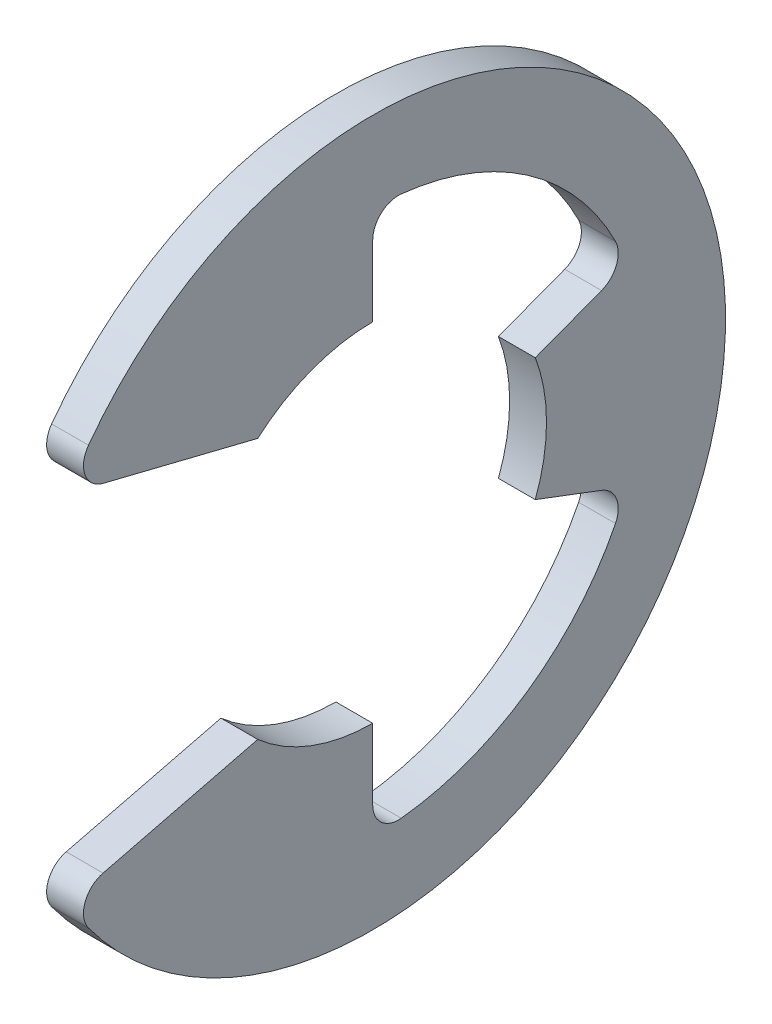
ISO-10303-21;
HEADER;
FILE_DESCRIPTION(('STEP AP214'),'2;1');
FILE_NAME('part.step','',(''),(''),'','','');
FILE_SCHEMA(('AUTOMOTIVE_DESIGN { 1 0 10303 214 1 1 1 1 }'));
ENDSEC;
DATA;
#1=APPLICATION_CONTEXT('core data for automotive mechanical design processes');
#2=APPLICATION_PROTOCOL_DEFINITION('international standard','automotive_design',2000,#1);
#3=PRODUCT_CONTEXT('',#1,'mechanical');
#4=PRODUCT('Part','Part','',(#3));
#5=PRODUCT_RELATED_PRODUCT_CATEGORY('part','',(#4));
#6=PRODUCT_DEFINITION_FORMATION('','',#4);
#7=PRODUCT_DEFINITION_CONTEXT('part definition',#1,'design');
#8=PRODUCT_DEFINITION('design','',#6,#7);
#9=PRODUCT_DEFINITION_SHAPE('','',#8);
#10=(LENGTH_UNIT() NAMED_UNIT(*) SI_UNIT(.MILLI.,.METRE.));
#11=(NAMED_UNIT(*) PLANE_ANGLE_UNIT() SI_UNIT($,.RADIAN.));
#12=(NAMED_UNIT(*) SI_UNIT($,.STERADIAN.) SOLID_ANGLE_UNIT());
#13=UNCERTAINTY_MEASURE_WITH_UNIT(LENGTH_MEASURE(1.E-05),#10,'distance_accuracy_value','');
#14=(GEOMETRIC_REPRESENTATION_CONTEXT(3) GLOBAL_UNCERTAINTY_ASSIGNED_CONTEXT((#13)) GLOBAL_UNIT_ASSIGNED_CONTEXT((#10,
#11,#12)) REPRESENTATION_CONTEXT('',''));
#15=CARTESIAN_POINT('',(0.,0.,0.));
#16=DIRECTION('',(0.,0.,1.));
#17=DIRECTION('',(1.,0.,0.));
#18=AXIS2_PLACEMENT_3D('',#15,#16,#17);
#19=CARTESIAN_POINT('',(-0.5334,0.,0.));
#20=DIRECTION('',(1.,0.,0.));
#21=DIRECTION('',(0.,0.,-1.));
#22=AXIS2_PLACEMENT_3D('',#19,#20,#21);
#23=PLANE('',#22);
#24=CARTESIAN_POINT('',(-0.5334,-5.60812276543936,7.62345146041875));
#25=DIRECTION('',(-1.,0.,0.));
#26=DIRECTION('',(0.,0.,1.));
#27=AXIS2_PLACEMENT_3D('',#24,#25,#26);
#28=CIRCLE('',#27,0.746760000000001);
#29=CARTESIAN_POINT('',(-0.5334,-4.88336468232429,7.80338538873514));
#30=VERTEX_POINT('',#29);
#31=CARTESIAN_POINT('',(-0.5334,-6.05063164709239,8.22497983652265));
#32=VERTEX_POINT('',#31);
#33=EDGE_CURVE('E20',#30,#32,#28,.F.);
#34=ORIENTED_EDGE('',*,*,#33,.F.);
#35=DIRECTION('',(0.,0.240952820606873,-0.970536829925373));
#36=VECTOR('',#35,1.);
#37=CARTESIAN_POINT('',(-0.5334,-5.13688856516319,8.82455735485331));
#38=LINE('',#37,#36);
#39=CARTESIAN_POINT('',(-0.5334,-3.7719,3.32650312340151));
#40=VERTEX_POINT('',#39);
#41=EDGE_CURVE('E144',#30,#40,#38,.T.);
#42=ORIENTED_EDGE('',*,*,#41,.T.);
#43=CARTESIAN_POINT('',(-0.5334,0.,0.));
#44=DIRECTION('',(-1.,0.,0.));
#45=DIRECTION('',(0.,0.,1.));
#46=AXIS2_PLACEMENT_3D('',#43,#44,#45);
#47=CIRCLE('',#46,5.0292);
#48=CARTESIAN_POINT('',(-0.5334,-5.0292,0.));
#49=VERTEX_POINT('',#48);
#50=EDGE_CURVE('E222',#40,#49,#47,.F.);
#51=ORIENTED_EDGE('',*,*,#50,.T.);
#52=DIRECTION('',(0.,-1.,0.));
#53=VECTOR('',#52,1.);
#54=CARTESIAN_POINT('',(-0.5334,-5.0292,0.));
#55=LINE('',#54,#53);
#56=CARTESIAN_POINT('',(-0.5334,-7.07977202193844,0.));
#57=VERTEX_POINT('',#56);
#58=EDGE_CURVE('E165',#49,#57,#55,.T.);
#59=ORIENTED_EDGE('',*,*,#58,.T.);
#60=CARTESIAN_POINT('',(-0.5334,-7.07977202193844,-0.74676));
#61=DIRECTION('',(-1.,0.,0.));
#62=DIRECTION('',(0.,0.,1.));
#63=AXIS2_PLACEMENT_3D('',#60,#61,#62);
#64=CIRCLE('',#63,0.74676);
#65=CARTESIAN_POINT('',(-0.5334,-7.82241228858608,-0.825092189765901));
#66=VERTEX_POINT('',#65);
#67=EDGE_CURVE('E224',#57,#66,#64,.F.);
#68=ORIENTED_EDGE('',*,*,#67,.T.);
#69=CARTESIAN_POINT('',(-0.5334,0.,0.));
#70=DIRECTION('',(-1.,0.,0.));
#71=DIRECTION('',(0.,0.,1.));
#72=AXIS2_PLACEMENT_3D('',#69,#70,#71);
#73=CIRCLE('',#72,7.8658064516129);
#74=CARTESIAN_POINT('',(-0.5334,-3.53744345889986,-7.02548253925108));
#75=VERTEX_POINT('',#74);
#76=EDGE_CURVE('E226',#66,#75,#73,.F.);
#77=ORIENTED_EDGE('',*,*,#76,.T.);
#78=CARTESIAN_POINT('',(-0.5334,-3.20160742052056,-6.35850079068093));
#79=DIRECTION('',(-1.,0.,0.));
#80=DIRECTION('',(0.,0.,1.));
#81=AXIS2_PLACEMENT_3D('',#78,#79,#80);
#82=CIRCLE('',#81,0.74676);
#83=CARTESIAN_POINT('',(-0.5334,-2.50307740298373,-6.62252032064036));
#84=VERTEX_POINT('',#83);
#85=EDGE_CURVE('E172',#75,#84,#82,.F.);
#86=ORIENTED_EDGE('',*,*,#85,.T.);
#87=DIRECTION('',(0.,0.353553390593273,0.935414346693486));
#88=VECTOR('',#87,1.);
#89=CARTESIAN_POINT('',(-0.5334,-1.77809071197169,-4.70438583239088));
#90=LINE('',#89,#88);
#91=CARTESIAN_POINT('',(-0.5334,-1.77809071197169,-4.70438583239088));
#92=VERTEX_POINT('',#91);
#93=EDGE_CURVE('E169',#84,#92,#90,.T.);
#94=ORIENTED_EDGE('',*,*,#93,.T.);
#95=CARTESIAN_POINT('',(-0.5334,0.,0.));
#96=DIRECTION('',(-1.,0.,0.));
#97=DIRECTION('',(0.,0.,1.));
#98=AXIS2_PLACEMENT_3D('',#95,#96,#97);
#99=CIRCLE('',#98,5.0292);
#100=CARTESIAN_POINT('',(-0.5334,1.77809071197169,-4.70438583239087));
#101=VERTEX_POINT('',#100);
#102=EDGE_CURVE('E232',#92,#101,#99,.F.);
#103=ORIENTED_EDGE('',*,*,#102,.T.);
#104=DIRECTION('',(0.,0.353553390593273,-0.935414346693486));
#105=VECTOR('',#104,1.);
#106=CARTESIAN_POINT('',(-0.5334,1.77809071197169,-4.70438583239088));
#107=LINE('',#106,#105);
#108=CARTESIAN_POINT('',(-0.5334,2.50307740298373,-6.62252032064036));
#109=VERTEX_POINT('',#108);
#110=EDGE_CURVE('E174',#101,#109,#107,.T.);
#111=ORIENTED_EDGE('',*,*,#110,.T.);
#112=CARTESIAN_POINT('',(-0.5334,3.20160742052056,-6.35850079068093));
#113=DIRECTION('',(-1.,0.,0.));
#114=DIRECTION('',(0.,0.,1.));
#115=AXIS2_PLACEMENT_3D('',#112,#113,#114);
#116=CIRCLE('',#115,0.74676);
#117=CARTESIAN_POINT('',(-0.5334,3.53744345889986,-7.02548253925108));
#118=VERTEX_POINT('',#117);
#119=EDGE_CURVE('E236',#109,#118,#116,.F.);
#120=ORIENTED_EDGE('',*,*,#119,.T.);
#121=CARTESIAN_POINT('',(-0.5334,0.,0.));
#122=DIRECTION('',(-1.,0.,0.));
#123=DIRECTION('',(0.,0.,1.));
#124=AXIS2_PLACEMENT_3D('',#121,#122,#123);
#125=CIRCLE('',#124,7.8658064516129);
#126=CARTESIAN_POINT('',(-0.5334,7.82241228858608,-0.825092189765899));
#127=VERTEX_POINT('',#126);
#128=EDGE_CURVE('E239',#118,#127,#125,.F.);
#129=ORIENTED_EDGE('',*,*,#128,.T.);
#130=CARTESIAN_POINT('',(-0.5334,7.07977202193844,-0.746759999999999));
#131=DIRECTION('',(-1.,0.,0.));
#132=DIRECTION('',(0.,0.,1.));
#133=AXIS2_PLACEMENT_3D('',#130,#131,#132);
#134=CIRCLE('',#133,0.74676);
#135=CARTESIAN_POINT('',(-0.5334,7.07977202193844,0.));
#136=VERTEX_POINT('',#135);
#137=EDGE_CURVE('E181',#127,#136,#134,.F.);
#138=ORIENTED_EDGE('',*,*,#137,.T.);
#139=DIRECTION('',(0.,-1.,0.));
#140=VECTOR('',#139,1.);
#141=CARTESIAN_POINT('',(-0.5334,5.0292,0.));
#142=LINE('',#141,#140);
#143=CARTESIAN_POINT('',(-0.5334,5.0292,0.));
#144=VERTEX_POINT('',#143);
#145=EDGE_CURVE('E178',#136,#144,#142,.T.);
#146=ORIENTED_EDGE('',*,*,#145,.T.);
#147=CARTESIAN_POINT('',(-0.5334,0.,0.));
#148=DIRECTION('',(-1.,0.,0.));
#149=DIRECTION('',(0.,0.,1.));
#150=AXIS2_PLACEMENT_3D('',#147,#148,#149);
#151=CIRCLE('',#150,5.0292);
#152=CARTESIAN_POINT('',(-0.5334,3.7719,3.32650312340151));
#153=VERTEX_POINT('',#152);
#154=EDGE_CURVE('E243',#144,#153,#151,.F.);
#155=ORIENTED_EDGE('',*,*,#154,.T.);
#156=DIRECTION('',(0.,0.240952820606873,0.970536829925373));
#157=VECTOR('',#156,1.);
#158=CARTESIAN_POINT('',(-0.5334,5.13688856516319,8.82455735485332));
#159=LINE('',#158,#157);
#160=CARTESIAN_POINT('',(-0.5334,4.88336468232429,7.80338538873514));
#161=VERTEX_POINT('',#160);
#162=EDGE_CURVE('E183',#153,#161,#159,.T.);
#163=ORIENTED_EDGE('',*,*,#162,.T.);
#164=CARTESIAN_POINT('',(-0.5334,5.60812276543936,7.62345146041875));
#165=DIRECTION('',(-1.,0.,0.));
#166=DIRECTION('',(0.,0.,1.));
#167=AXIS2_PLACEMENT_3D('',#164,#165,#166);
#168=CIRCLE('',#167,0.74676);
#169=CARTESIAN_POINT('',(-0.5334,6.05063164709238,8.22497983652265));
#170=VERTEX_POINT('',#169);
#171=EDGE_CURVE('E185',#170,#161,#168,.F.);
#172=ORIENTED_EDGE('',*,*,#171,.F.);
#173=CARTESIAN_POINT('',(-0.5334,0.,0.));
#174=DIRECTION('',(-1.,0.,0.));
#175=DIRECTION('',(0.,0.,1.));
#176=AXIS2_PLACEMENT_3D('',#173,#174,#175);
#177=CIRCLE('',#176,10.2108);
#178=EDGE_CURVE('E147',#32,#170,#177,.F.);
#179=ORIENTED_EDGE('',*,*,#178,.F.);
#180=EDGE_LOOP('',(#34,#42,#51,#59,#68,#77,#86,#94,#103,#111,#120,#129,#138,#146,#155,#163,#172,#179));
#181=FACE_BOUND('',#180,.T.);
#182=ADVANCED_FACE('F17',(#181),#23,.F.);
#183=CARTESIAN_POINT('',(0.5334,-5.13688856516319,8.82455735485331));
#184=DIRECTION('',(0.,-0.970536829925373,-0.240952820606873));
#185=DIRECTION('',(0.,0.240952820606873,-0.970536829925373));
#186=AXIS2_PLACEMENT_3D('',#183,#184,#185);
#187=PLANE('',#186);
#188=DIRECTION('',(-1.,0.,0.));
#189=VECTOR('',#188,1.);
#190=CARTESIAN_POINT('',(0.5334,-4.88336468232429,7.80338538873514));
#191=LINE('',#190,#189);
#192=CARTESIAN_POINT('',(0.5334,-4.88336468232429,7.80338538873514));
#193=VERTEX_POINT('',#192);
#194=EDGE_CURVE('E150',#193,#30,#191,.T.);
#195=ORIENTED_EDGE('',*,*,#194,.F.);
#196=DIRECTION('',(0.,-0.240952820606873,0.970536829925373));
#197=VECTOR('',#196,1.);
#198=CARTESIAN_POINT('',(0.5334,-3.7719,3.32650312340151));
#199=LINE('',#198,#197);
#200=CARTESIAN_POINT('',(0.5334,-3.7719,3.32650312340151));
#201=VERTEX_POINT('',#200);
#202=EDGE_CURVE('E221',#201,#193,#199,.T.);
#203=ORIENTED_EDGE('',*,*,#202,.F.);
#204=DIRECTION('',(-1.,0.,0.));
#205=VECTOR('',#204,1.);
#206=CARTESIAN_POINT('',(0.5334,-3.7719,3.32650312340151));
#207=LINE('',#206,#205);
#208=EDGE_CURVE('E155',#201,#40,#207,.T.);
#209=ORIENTED_EDGE('',*,*,#208,.T.);
#210=ORIENTED_EDGE('',*,*,#41,.F.);
#211=EDGE_LOOP('',(#195,#203,#209,#210));
#212=FACE_BOUND('',#211,.T.);
#213=ADVANCED_FACE('F152',(#212),#187,.F.);
#214=CARTESIAN_POINT('',(0.5334,-5.60812276543936,7.62345146041875));
#215=DIRECTION('',(-1.,0.,0.));
#216=DIRECTION('',(0.,0.,1.));
#217=AXIS2_PLACEMENT_3D('',#214,#215,#216);
#218=CYLINDRICAL_SURFACE('',#217,0.746760000000001);
#219=ORIENTED_EDGE('',*,*,#33,.T.);
#220=DIRECTION('',(-1.,0.,0.));
#221=VECTOR('',#220,1.);
#222=CARTESIAN_POINT('',(0.5334,-6.05063164709239,8.22497983652265));
#223=LINE('',#222,#221);
#224=CARTESIAN_POINT('',(0.5334,-6.05063164709239,8.22497983652265));
#225=VERTEX_POINT('',#224);
#226=EDGE_CURVE('E149',#225,#32,#223,.T.);
#227=ORIENTED_EDGE('',*,*,#226,.F.);
#228=CARTESIAN_POINT('',(0.5334,-5.60812276543936,7.62345146041875));
#229=DIRECTION('',(-1.,0.,0.));
#230=DIRECTION('',(0.,0.,1.));
#231=AXIS2_PLACEMENT_3D('',#228,#229,#230);
#232=CIRCLE('',#231,0.746760000000001);
#233=EDGE_CURVE('E159',#193,#225,#232,.F.);
#234=ORIENTED_EDGE('',*,*,#233,.F.);
#235=ORIENTED_EDGE('',*,*,#194,.T.);
#236=EDGE_LOOP('',(#219,#227,#234,#235));
#237=FACE_BOUND('',#236,.T.);
#238=ADVANCED_FACE('F158',(#237),#218,.T.);
#239=CARTESIAN_POINT('',(0.5334,0.,0.));
#240=DIRECTION('',(-1.,0.,0.));
#241=DIRECTION('',(0.,0.,1.));
#242=AXIS2_PLACEMENT_3D('',#239,#240,#241);
#243=CYLINDRICAL_SURFACE('',#242,10.2108);
#244=ORIENTED_EDGE('',*,*,#178,.T.);
#245=DIRECTION('',(-1.,0.,0.));
#246=VECTOR('',#245,1.);
#247=CARTESIAN_POINT('',(0.5334,6.05063164709238,8.22497983652265));
#248=LINE('',#247,#246);
#249=CARTESIAN_POINT('',(0.5334,6.05063164709238,8.22497983652265));
#250=VERTEX_POINT('',#249);
#251=EDGE_CURVE('E248',#250,#170,#248,.T.);
#252=ORIENTED_EDGE('',*,*,#251,.F.);
#253=CARTESIAN_POINT('',(0.5334,0.,0.));
#254=DIRECTION('',(-1.,0.,0.));
#255=DIRECTION('',(0.,0.,1.));
#256=AXIS2_PLACEMENT_3D('',#253,#254,#255);
#257=CIRCLE('',#256,10.2108);
#258=EDGE_CURVE('E217',#225,#250,#257,.F.);
#259=ORIENTED_EDGE('',*,*,#258,.F.);
#260=ORIENTED_EDGE('',*,*,#226,.T.);
#261=EDGE_LOOP('',(#244,#252,#259,#260));
#262=FACE_BOUND('',#261,.T.);
#263=ADVANCED_FACE('F252',(#262),#243,.T.);
#264=CARTESIAN_POINT('',(0.5334,5.60812276543936,7.62345146041875));
#265=DIRECTION('',(-1.,0.,0.));
#266=DIRECTION('',(0.,0.,1.));
#267=AXIS2_PLACEMENT_3D('',#264,#265,#266);
#268=CYLINDRICAL_SURFACE('',#267,0.74676);
#269=ORIENTED_EDGE('',*,*,#171,.T.);
#270=DIRECTION('',(1.,0.,0.));
#271=VECTOR('',#270,1.);
#272=CARTESIAN_POINT('',(0.5334,4.88336468232429,7.80338538873514));
#273=LINE('',#272,#271);
#274=CARTESIAN_POINT('',(0.5334,4.88336468232429,7.80338538873514));
#275=VERTEX_POINT('',#274);
#276=EDGE_CURVE('E184',#161,#275,#273,.T.);
#277=ORIENTED_EDGE('',*,*,#276,.T.);
#278=CARTESIAN_POINT('',(0.5334,5.60812276543936,7.62345146041875));
#279=DIRECTION('',(-1.,0.,0.));
#280=DIRECTION('',(0.,0.,1.));
#281=AXIS2_PLACEMENT_3D('',#278,#279,#280);
#282=CIRCLE('',#281,0.74676);
#283=EDGE_CURVE('E215',#250,#275,#282,.F.);
#284=ORIENTED_EDGE('',*,*,#283,.F.);
#285=ORIENTED_EDGE('',*,*,#251,.T.);
#286=EDGE_LOOP('',(#269,#277,#284,#285));
#287=FACE_BOUND('',#286,.T.);
#288=ADVANCED_FACE('F280',(#287),#268,.T.);
#289=CARTESIAN_POINT('',(0.5334,5.13688856516319,8.82455735485332));
#290=DIRECTION('',(0.,0.970536829925373,-0.240952820606873));
#291=DIRECTION('',(0.,0.240952820606873,0.970536829925373));
#292=AXIS2_PLACEMENT_3D('',#289,#290,#291);
#293=PLANE('',#292);
#294=ORIENTED_EDGE('',*,*,#276,.F.);
#295=ORIENTED_EDGE('',*,*,#162,.F.);
#296=DIRECTION('',(-1.,0.,0.));
#297=VECTOR('',#296,1.);
#298=CARTESIAN_POINT('',(0.5334,3.7719,3.32650312340151));
#299=LINE('',#298,#297);
#300=CARTESIAN_POINT('',(0.5334,3.7719,3.32650312340151));
#301=VERTEX_POINT('',#300);
#302=EDGE_CURVE('E246',#153,#301,#299,.F.);
#303=ORIENTED_EDGE('',*,*,#302,.T.);
#304=DIRECTION('',(0.,-0.240952820606873,-0.970536829925373));
#305=VECTOR('',#304,1.);
#306=CARTESIAN_POINT('',(0.5334,4.88336468232429,7.80338538873514));
#307=LINE('',#306,#305);
#308=EDGE_CURVE('E214',#275,#301,#307,.T.);
#309=ORIENTED_EDGE('',*,*,#308,.F.);
#310=EDGE_LOOP('',(#294,#295,#303,#309));
#311=FACE_BOUND('',#310,.T.);
#312=ADVANCED_FACE('F282',(#311),#293,.F.);
#313=CARTESIAN_POINT('',(0.5334,0.,0.));
#314=DIRECTION('',(-1.,0.,0.));
#315=DIRECTION('',(0.,0.,1.));
#316=AXIS2_PLACEMENT_3D('',#313,#314,#315);
#317=CYLINDRICAL_SURFACE('',#316,5.0292);
#318=DIRECTION('',(1.,0.,0.));
#319=VECTOR('',#318,1.);
#320=CARTESIAN_POINT('',(0.5334,5.0292,0.));
#321=LINE('',#320,#319);
#322=CARTESIAN_POINT('',(0.5334,5.0292,0.));
#323=VERTEX_POINT('',#322);
#324=EDGE_CURVE('E182',#144,#323,#321,.T.);
#325=ORIENTED_EDGE('',*,*,#324,.T.);
#326=CARTESIAN_POINT('',(0.5334,0.,0.));
#327=DIRECTION('',(-1.,0.,0.));
#328=DIRECTION('',(0.,0.,1.));
#329=AXIS2_PLACEMENT_3D('',#326,#327,#328);
#330=CIRCLE('',#329,5.0292);
#331=EDGE_CURVE('E211',#301,#323,#330,.T.);
#332=ORIENTED_EDGE('',*,*,#331,.F.);
#333=ORIENTED_EDGE('',*,*,#302,.F.);
#334=ORIENTED_EDGE('',*,*,#154,.F.);
#335=EDGE_LOOP('',(#325,#332,#333,#334));
#336=FACE_BOUND('',#335,.T.);
#337=ADVANCED_FACE('F288',(#336),#317,.F.);
#338=CARTESIAN_POINT('',(0.5334,5.0292,0.));
#339=DIRECTION('',(0.,0.,1.));
#340=DIRECTION('',(0.,-1.,0.));
#341=AXIS2_PLACEMENT_3D('',#338,#339,#340);
#342=PLANE('',#341);
#343=DIRECTION('',(-1.,0.,0.));
#344=VECTOR('',#343,1.);
#345=CARTESIAN_POINT('',(0.5334,7.07977202193844,0.));
#346=LINE('',#345,#344);
#347=CARTESIAN_POINT('',(0.5334,7.07977202193844,0.));
#348=VERTEX_POINT('',#347);
#349=EDGE_CURVE('E241',#136,#348,#346,.F.);
#350=ORIENTED_EDGE('',*,*,#349,.T.);
#351=DIRECTION('',(0.,1.,0.));
#352=VECTOR('',#351,1.);
#353=CARTESIAN_POINT('',(0.5334,0.,0.));
#354=LINE('',#353,#352);
#355=EDGE_CURVE('E210',#323,#348,#354,.T.);
#356=ORIENTED_EDGE('',*,*,#355,.F.);
#357=ORIENTED_EDGE('',*,*,#324,.F.);
#358=ORIENTED_EDGE('',*,*,#145,.F.);
#359=EDGE_LOOP('',(#350,#356,#357,#358));
#360=FACE_BOUND('',#359,.T.);
#361=ADVANCED_FACE('F292',(#360),#342,.F.);
#362=CARTESIAN_POINT('',(0.5334,7.07977202193844,-0.746759999999999));
#363=DIRECTION('',(-1.,0.,0.));
#364=DIRECTION('',(0.,0.,1.));
#365=AXIS2_PLACEMENT_3D('',#362,#363,#364);
#366=CYLINDRICAL_SURFACE('',#365,0.74676);
#367=ORIENTED_EDGE('',*,*,#349,.F.);
#368=ORIENTED_EDGE('',*,*,#137,.F.);
#369=DIRECTION('',(-1.,0.,0.));
#370=VECTOR('',#369,1.);
#371=CARTESIAN_POINT('',(0.5334,7.82241228858608,-0.8250921897659));
#372=LINE('',#371,#370);
#373=CARTESIAN_POINT('',(0.5334,7.82241228858608,-0.825092189765899));
#374=VERTEX_POINT('',#373);
#375=EDGE_CURVE('E238',#127,#374,#372,.F.);
#376=ORIENTED_EDGE('',*,*,#375,.T.);
#377=CARTESIAN_POINT('',(0.5334,7.07977202193844,-0.746759999999999));
#378=DIRECTION('',(-1.,0.,0.));
#379=DIRECTION('',(0.,0.,1.));
#380=AXIS2_PLACEMENT_3D('',#377,#378,#379);
#381=CIRCLE('',#380,0.74676);
#382=EDGE_CURVE('E207',#348,#374,#381,.T.);
#383=ORIENTED_EDGE('',*,*,#382,.F.);
#384=EDGE_LOOP('',(#367,#368,#376,#383));
#385=FACE_BOUND('',#384,.T.);
#386=ADVANCED_FACE('F341',(#385),#366,.F.);
#387=CARTESIAN_POINT('',(0.5334,0.,0.));
#388=DIRECTION('',(-1.,0.,0.));
#389=DIRECTION('',(0.,0.,1.));
#390=AXIS2_PLACEMENT_3D('',#387,#388,#389);
#391=CYLINDRICAL_SURFACE('',#390,7.8658064516129);
#392=ORIENTED_EDGE('',*,*,#375,.F.);
#393=ORIENTED_EDGE('',*,*,#128,.F.);
#394=DIRECTION('',(-1.,0.,0.));
#395=VECTOR('',#394,1.);
#396=CARTESIAN_POINT('',(0.5334,3.53744345889986,-7.02548253925108));
#397=LINE('',#396,#395);
#398=CARTESIAN_POINT('',(0.5334,3.53744345889986,-7.02548253925108));
#399=VERTEX_POINT('',#398);
#400=EDGE_CURVE('E177',#118,#399,#397,.F.);
#401=ORIENTED_EDGE('',*,*,#400,.T.);
#402=CARTESIAN_POINT('',(0.5334,0.,0.));
#403=DIRECTION('',(-1.,0.,0.));
#404=DIRECTION('',(0.,0.,1.));
#405=AXIS2_PLACEMENT_3D('',#402,#403,#404);
#406=CIRCLE('',#405,7.8658064516129);
#407=EDGE_CURVE('E204',#374,#399,#406,.T.);
#408=ORIENTED_EDGE('',*,*,#407,.F.);
#409=EDGE_LOOP('',(#392,#393,#401,#408));
#410=FACE_BOUND('',#409,.T.);
#411=ADVANCED_FACE('F338',(#410),#391,.F.);
#412=CARTESIAN_POINT('',(0.5334,3.20160742052056,-6.35850079068093));
#413=DIRECTION('',(-1.,0.,0.));
#414=DIRECTION('',(0.,0.,1.));
#415=AXIS2_PLACEMENT_3D('',#412,#413,#414);
#416=CYLINDRICAL_SURFACE('',#415,0.74676);
#417=ORIENTED_EDGE('',*,*,#400,.F.);
#418=ORIENTED_EDGE('',*,*,#119,.F.);
#419=DIRECTION('',(1.,0.,0.));
#420=VECTOR('',#419,1.);
#421=CARTESIAN_POINT('',(0.5334,2.50307740298373,-6.62252032064036));
#422=LINE('',#421,#420);
#423=CARTESIAN_POINT('',(0.5334,2.50307740298373,-6.62252032064036));
#424=VERTEX_POINT('',#423);
#425=EDGE_CURVE('E176',#109,#424,#422,.T.);
#426=ORIENTED_EDGE('',*,*,#425,.T.);
#427=CARTESIAN_POINT('',(0.5334,3.20160742052056,-6.35850079068093));
#428=DIRECTION('',(-1.,0.,0.));
#429=DIRECTION('',(0.,0.,1.));
#430=AXIS2_PLACEMENT_3D('',#427,#428,#429);
#431=CIRCLE('',#430,0.74676);
#432=EDGE_CURVE('E201',#399,#424,#431,.T.);
#433=ORIENTED_EDGE('',*,*,#432,.F.);
#434=EDGE_LOOP('',(#417,#418,#426,#433));
#435=FACE_BOUND('',#434,.T.);
#436=ADVANCED_FACE('F331',(#435),#416,.F.);
#437=CARTESIAN_POINT('',(0.5334,1.77809071197169,-4.70438583239088));
#438=DIRECTION('',(0.,-0.935414346693486,-0.353553390593273));
#439=DIRECTION('',(0.,0.353553390593273,-0.935414346693486));
#440=AXIS2_PLACEMENT_3D('',#437,#438,#439);
#441=PLANE('',#440);
#442=ORIENTED_EDGE('',*,*,#425,.F.);
#443=ORIENTED_EDGE('',*,*,#110,.F.);
#444=DIRECTION('',(-1.,0.,0.));
#445=VECTOR('',#444,1.);
#446=CARTESIAN_POINT('',(0.5334,1.77809071197169,-4.70438583239087));
#447=LINE('',#446,#445);
#448=CARTESIAN_POINT('',(0.5334,1.77809071197169,-4.70438583239087));
#449=VERTEX_POINT('',#448);
#450=EDGE_CURVE('E235',#101,#449,#447,.F.);
#451=ORIENTED_EDGE('',*,*,#450,.T.);
#452=DIRECTION('',(0.,-0.353553390593273,0.935414346693486));
#453=VECTOR('',#452,1.);
#454=CARTESIAN_POINT('',(0.5334,2.50307740298373,-6.62252032064036));
#455=LINE('',#454,#453);
#456=EDGE_CURVE('E200',#424,#449,#455,.T.);
#457=ORIENTED_EDGE('',*,*,#456,.F.);
#458=EDGE_LOOP('',(#442,#443,#451,#457));
#459=FACE_BOUND('',#458,.T.);
#460=ADVANCED_FACE('F334',(#459),#441,.F.);
#461=CARTESIAN_POINT('',(0.5334,0.,0.));
#462=DIRECTION('',(-1.,0.,0.));
#463=DIRECTION('',(0.,0.,1.));
#464=AXIS2_PLACEMENT_3D('',#461,#462,#463);
#465=CYLINDRICAL_SURFACE('',#464,5.0292);
#466=DIRECTION('',(1.,0.,0.));
#467=VECTOR('',#466,1.);
#468=CARTESIAN_POINT('',(0.5334,-1.77809071197169,-4.70438583239088));
#469=LINE('',#468,#467);
#470=CARTESIAN_POINT('',(0.5334,-1.77809071197169,-4.70438583239088));
#471=VERTEX_POINT('',#470);
#472=EDGE_CURVE('E173',#92,#471,#469,.T.);
#473=ORIENTED_EDGE('',*,*,#472,.T.);
#474=CARTESIAN_POINT('',(0.5334,0.,0.));
#475=DIRECTION('',(-1.,0.,0.));
#476=DIRECTION('',(0.,0.,1.));
#477=AXIS2_PLACEMENT_3D('',#474,#475,#476);
#478=CIRCLE('',#477,5.0292);
#479=EDGE_CURVE('E197',#449,#471,#478,.T.);
#480=ORIENTED_EDGE('',*,*,#479,.F.);
#481=ORIENTED_EDGE('',*,*,#450,.F.);
#482=ORIENTED_EDGE('',*,*,#102,.F.);
#483=EDGE_LOOP('',(#473,#480,#481,#482));
#484=FACE_BOUND('',#483,.T.);
#485=ADVANCED_FACE('F323',(#484),#465,.F.);
#486=CARTESIAN_POINT('',(0.5334,-1.77809071197169,-4.70438583239088));
#487=DIRECTION('',(0.,0.935414346693486,-0.353553390593273));
#488=DIRECTION('',(0.,0.353553390593273,0.935414346693486));
#489=AXIS2_PLACEMENT_3D('',#486,#487,#488);
#490=PLANE('',#489);
#491=DIRECTION('',(-1.,0.,0.));
#492=VECTOR('',#491,1.);
#493=CARTESIAN_POINT('',(0.5334,-2.50307740298373,-6.62252032064036));
#494=LINE('',#493,#492);
#495=CARTESIAN_POINT('',(0.5334,-2.50307740298373,-6.62252032064036));
#496=VERTEX_POINT('',#495);
#497=EDGE_CURVE('E231',#84,#496,#494,.F.);
#498=ORIENTED_EDGE('',*,*,#497,.T.);
#499=DIRECTION('',(0.,-0.353553390593273,-0.935414346693486));
#500=VECTOR('',#499,1.);
#501=CARTESIAN_POINT('',(0.5334,-1.77809071197169,-4.70438583239088));
#502=LINE('',#501,#500);
#503=EDGE_CURVE('E196',#471,#496,#502,.T.);
#504=ORIENTED_EDGE('',*,*,#503,.F.);
#505=ORIENTED_EDGE('',*,*,#472,.F.);
#506=ORIENTED_EDGE('',*,*,#93,.F.);
#507=EDGE_LOOP('',(#498,#504,#505,#506));
#508=FACE_BOUND('',#507,.T.);
#509=ADVANCED_FACE('F319',(#508),#490,.F.);
#510=CARTESIAN_POINT('',(0.5334,-3.20160742052056,-6.35850079068093));
#511=DIRECTION('',(-1.,0.,0.));
#512=DIRECTION('',(0.,0.,1.));
#513=AXIS2_PLACEMENT_3D('',#510,#511,#512);
#514=CYLINDRICAL_SURFACE('',#513,0.74676);
#515=ORIENTED_EDGE('',*,*,#497,.F.);
#516=ORIENTED_EDGE('',*,*,#85,.F.);
#517=DIRECTION('',(-1.,0.,0.));
#518=VECTOR('',#517,1.);
#519=CARTESIAN_POINT('',(0.5334,-3.53744345889986,-7.02548253925108));
#520=LINE('',#519,#518);
#521=CARTESIAN_POINT('',(0.5334,-3.53744345889986,-7.02548253925108));
#522=VERTEX_POINT('',#521);
#523=EDGE_CURVE('E229',#75,#522,#520,.F.);
#524=ORIENTED_EDGE('',*,*,#523,.T.);
#525=CARTESIAN_POINT('',(0.5334,-3.20160742052056,-6.35850079068093));
#526=DIRECTION('',(-1.,0.,0.));
#527=DIRECTION('',(0.,0.,1.));
#528=AXIS2_PLACEMENT_3D('',#525,#526,#527);
#529=CIRCLE('',#528,0.74676);
#530=EDGE_CURVE('E193',#496,#522,#529,.T.);
#531=ORIENTED_EDGE('',*,*,#530,.F.);
#532=EDGE_LOOP('',(#515,#516,#524,#531));
#533=FACE_BOUND('',#532,.T.);
#534=ADVANCED_FACE('F315',(#533),#514,.F.);
#535=CARTESIAN_POINT('',(0.5334,0.,0.));
#536=DIRECTION('',(-1.,0.,0.));
#537=DIRECTION('',(0.,0.,1.));
#538=AXIS2_PLACEMENT_3D('',#535,#536,#537);
#539=CYLINDRICAL_SURFACE('',#538,7.8658064516129);
#540=DIRECTION('',(-1.,0.,0.));
#541=VECTOR('',#540,1.);
#542=CARTESIAN_POINT('',(0.5334,-7.82241228858608,-0.825092189765901));
#543=LINE('',#542,#541);
#544=CARTESIAN_POINT('',(0.5334,-7.82241228858608,-0.825092189765901));
#545=VERTEX_POINT('',#544);
#546=EDGE_CURVE('E168',#66,#545,#543,.F.);
#547=ORIENTED_EDGE('',*,*,#546,.T.);
#548=CARTESIAN_POINT('',(0.5334,0.,0.));
#549=DIRECTION('',(-1.,0.,0.));
#550=DIRECTION('',(0.,0.,1.));
#551=AXIS2_PLACEMENT_3D('',#548,#549,#550);
#552=CIRCLE('',#551,7.8658064516129);
#553=EDGE_CURVE('E190',#522,#545,#552,.T.);
#554=ORIENTED_EDGE('',*,*,#553,.F.);
#555=ORIENTED_EDGE('',*,*,#523,.F.);
#556=ORIENTED_EDGE('',*,*,#76,.F.);
#557=EDGE_LOOP('',(#547,#554,#555,#556));
#558=FACE_BOUND('',#557,.T.);
#559=ADVANCED_FACE('F310',(#558),#539,.F.);
#560=CARTESIAN_POINT('',(0.5334,-7.07977202193844,-0.74676));
#561=DIRECTION('',(-1.,0.,0.));
#562=DIRECTION('',(0.,0.,1.));
#563=AXIS2_PLACEMENT_3D('',#560,#561,#562);
#564=CYLINDRICAL_SURFACE('',#563,0.74676);
#565=ORIENTED_EDGE('',*,*,#546,.F.);
#566=ORIENTED_EDGE('',*,*,#67,.F.);
#567=DIRECTION('',(1.,0.,0.));
#568=VECTOR('',#567,1.);
#569=CARTESIAN_POINT('',(0.5334,-7.07977202193844,0.));
#570=LINE('',#569,#568);
#571=CARTESIAN_POINT('',(0.5334,-7.07977202193844,0.));
#572=VERTEX_POINT('',#571);
#573=EDGE_CURVE('E167',#57,#572,#570,.T.);
#574=ORIENTED_EDGE('',*,*,#573,.T.);
#575=CARTESIAN_POINT('',(0.5334,-7.07977202193844,-0.74676));
#576=DIRECTION('',(-1.,0.,0.));
#577=DIRECTION('',(0.,0.,1.));
#578=AXIS2_PLACEMENT_3D('',#575,#576,#577);
#579=CIRCLE('',#578,0.74676);
#580=EDGE_CURVE('E187',#545,#572,#579,.T.);
#581=ORIENTED_EDGE('',*,*,#580,.F.);
#582=EDGE_LOOP('',(#565,#566,#574,#581));
#583=FACE_BOUND('',#582,.T.);
#584=ADVANCED_FACE('F306',(#583),#564,.F.);
#585=CARTESIAN_POINT('',(0.5334,-5.0292,0.));
#586=DIRECTION('',(0.,0.,1.));
#587=DIRECTION('',(0.,-1.,0.));
#588=AXIS2_PLACEMENT_3D('',#585,#586,#587);
#589=PLANE('',#588);
#590=ORIENTED_EDGE('',*,*,#573,.F.);
#591=ORIENTED_EDGE('',*,*,#58,.F.);
#592=DIRECTION('',(-1.,0.,0.));
#593=VECTOR('',#592,1.);
#594=CARTESIAN_POINT('',(0.5334,-5.0292,0.));
#595=LINE('',#594,#593);
#596=CARTESIAN_POINT('',(0.5334,-5.0292,0.));
#597=VERTEX_POINT('',#596);
#598=EDGE_CURVE('E35',#49,#597,#595,.F.);
#599=ORIENTED_EDGE('',*,*,#598,.T.);
#600=DIRECTION('',(0.,1.,0.));
#601=VECTOR('',#600,1.);
#602=CARTESIAN_POINT('',(0.5334,0.,0.));
#603=LINE('',#602,#601);
#604=EDGE_CURVE('E26',#572,#597,#603,.T.);
#605=ORIENTED_EDGE('',*,*,#604,.F.);
#606=EDGE_LOOP('',(#590,#591,#599,#605));
#607=FACE_BOUND('',#606,.T.);
#608=ADVANCED_FACE('F302',(#607),#589,.F.);
#609=CARTESIAN_POINT('',(0.5334,0.,0.));
#610=DIRECTION('',(-1.,0.,0.));
#611=DIRECTION('',(0.,0.,1.));
#612=AXIS2_PLACEMENT_3D('',#609,#610,#611);
#613=CYLINDRICAL_SURFACE('',#612,5.0292);
#614=ORIENTED_EDGE('',*,*,#208,.F.);
#615=CARTESIAN_POINT('',(0.5334,0.,0.));
#616=DIRECTION('',(-1.,0.,0.));
#617=DIRECTION('',(0.,0.,1.));
#618=AXIS2_PLACEMENT_3D('',#615,#616,#617);
#619=CIRCLE('',#618,5.0292);
#620=EDGE_CURVE('E11',#597,#201,#619,.T.);
#621=ORIENTED_EDGE('',*,*,#620,.F.);
#622=ORIENTED_EDGE('',*,*,#598,.F.);
#623=ORIENTED_EDGE('',*,*,#50,.F.);
#624=EDGE_LOOP('',(#614,#621,#622,#623));
#625=FACE_BOUND('',#624,.T.);
#626=ADVANCED_FACE('F352',(#625),#613,.F.);
#627=CARTESIAN_POINT('',(0.5334,0.,0.));
#628=DIRECTION('',(1.,0.,0.));
#629=DIRECTION('',(0.,0.,-1.));
#630=AXIS2_PLACEMENT_3D('',#627,#628,#629);
#631=PLANE('',#630);
#632=ORIENTED_EDGE('',*,*,#604,.T.);
#633=ORIENTED_EDGE('',*,*,#620,.T.);
#634=ORIENTED_EDGE('',*,*,#202,.T.);
#635=ORIENTED_EDGE('',*,*,#233,.T.);
#636=ORIENTED_EDGE('',*,*,#258,.T.);
#637=ORIENTED_EDGE('',*,*,#283,.T.);
#638=ORIENTED_EDGE('',*,*,#308,.T.);
#639=ORIENTED_EDGE('',*,*,#331,.T.);
#640=ORIENTED_EDGE('',*,*,#355,.T.);
#641=ORIENTED_EDGE('',*,*,#382,.T.);
#642=ORIENTED_EDGE('',*,*,#407,.T.);
#643=ORIENTED_EDGE('',*,*,#432,.T.);
#644=ORIENTED_EDGE('',*,*,#456,.T.);
#645=ORIENTED_EDGE('',*,*,#479,.T.);
#646=ORIENTED_EDGE('',*,*,#503,.T.);
#647=ORIENTED_EDGE('',*,*,#530,.T.);
#648=ORIENTED_EDGE('',*,*,#553,.T.);
#649=ORIENTED_EDGE('',*,*,#580,.T.);
#650=EDGE_LOOP('',(#632,#633,#634,#635,#636,#637,#638,#639,#640,#641,#642,#643,#644,#645,#646,
#647,#648,#649));
#651=FACE_BOUND('',#650,.T.);
#652=ADVANCED_FACE('F256',(#651),#631,.T.);
#653=CLOSED_SHELL('',(#182,#213,#238,#263,#288,#312,#337,#361,#386,#411,#436,#460,#485,#509,
#534,#559,#584,#608,#626,#652));
#654=MANIFOLD_SOLID_BREP('B1',#653);
#655=ADVANCED_BREP_SHAPE_REPRESENTATION('',(#18,#654),#14);
#656=SHAPE_DEFINITION_REPRESENTATION(#9,#655);
ENDSEC;
END-ISO-10303-21;
